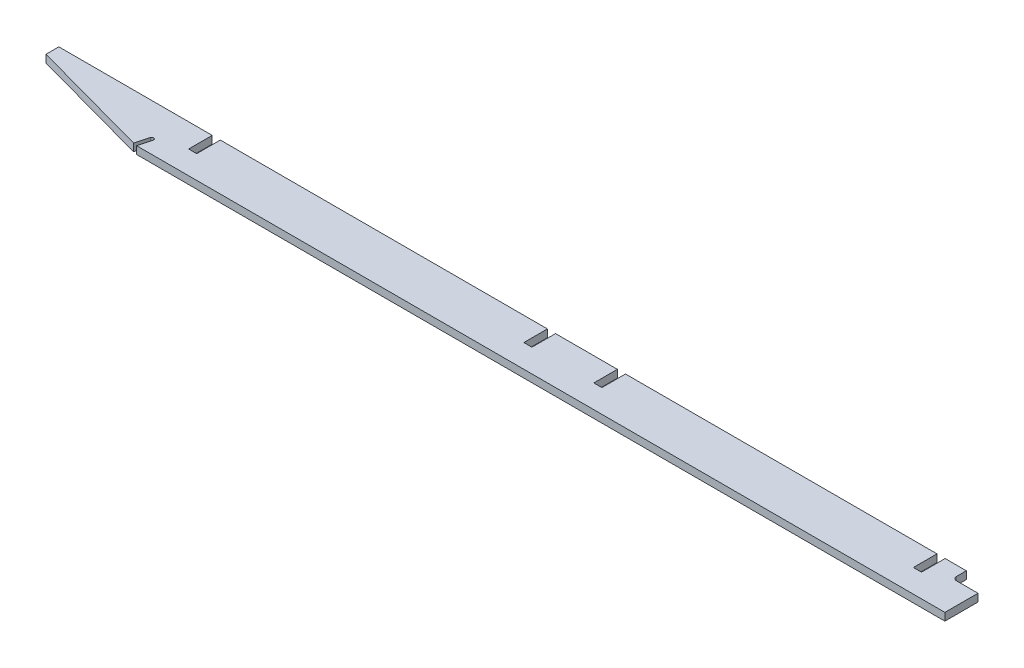
ISO-10303-21;
HEADER;
FILE_DESCRIPTION(('STEP AP214'),'2;1');
FILE_NAME('part.step','',(''),(''),'','','');
FILE_SCHEMA(('AUTOMOTIVE_DESIGN { 1 0 10303 214 1 1 1 1 }'));
ENDSEC;
DATA;
#1=APPLICATION_CONTEXT('core data for automotive mechanical design processes');
#2=APPLICATION_PROTOCOL_DEFINITION('international standard','automotive_design',2000,#1);
#3=PRODUCT_CONTEXT('',#1,'mechanical');
#4=PRODUCT('Part','Part','',(#3));
#5=PRODUCT_RELATED_PRODUCT_CATEGORY('part','',(#4));
#6=PRODUCT_DEFINITION_FORMATION('','',#4);
#7=PRODUCT_DEFINITION_CONTEXT('part definition',#1,'design');
#8=PRODUCT_DEFINITION('design','',#6,#7);
#9=PRODUCT_DEFINITION_SHAPE('','',#8);
#10=(LENGTH_UNIT() NAMED_UNIT(*) SI_UNIT(.MILLI.,.METRE.));
#11=(NAMED_UNIT(*) PLANE_ANGLE_UNIT() SI_UNIT($,.RADIAN.));
#12=(NAMED_UNIT(*) SI_UNIT($,.STERADIAN.) SOLID_ANGLE_UNIT());
#13=UNCERTAINTY_MEASURE_WITH_UNIT(LENGTH_MEASURE(1.E-05),#10,'distance_accuracy_value','');
#14=(GEOMETRIC_REPRESENTATION_CONTEXT(3) GLOBAL_UNCERTAINTY_ASSIGNED_CONTEXT((#13)) GLOBAL_UNIT_ASSIGNED_CONTEXT((#10,
#11,#12)) REPRESENTATION_CONTEXT('',''));
#15=CARTESIAN_POINT('',(0.,0.,0.));
#16=DIRECTION('',(0.,0.,1.));
#17=DIRECTION('',(1.,0.,0.));
#18=AXIS2_PLACEMENT_3D('',#15,#16,#17);
#19=CARTESIAN_POINT('',(-1457.76984888733,387.096,38.1));
#20=DIRECTION('',(-0.26471698178117,0.,0.964326147917118));
#21=DIRECTION('',(0.964326147917118,0.,0.26471698178117));
#22=AXIS2_PLACEMENT_3D('',#19,#20,#21);
#23=PLANE('',#22);
#24=DIRECTION('',(-0.964326147917118,0.,-0.26471698178117));
#25=VECTOR('',#24,1.);
#26=CARTESIAN_POINT('',(-1457.76984888733,374.65,38.1));
#27=LINE('',#26,#25);
#28=CARTESIAN_POINT('',(-1323.73398806948,374.65,74.8941578715673));
#29=VERTEX_POINT('',#28);
#30=CARTESIAN_POINT('',(-1520.36270603019,374.65,20.9176470588235));
#31=VERTEX_POINT('',#30);
#32=EDGE_CURVE('E696',#29,#31,#27,.T.);
#33=ORIENTED_EDGE('',*,*,#32,.F.);
#34=DIRECTION('',(0.,1.,0.));
#35=VECTOR('',#34,1.);
#36=CARTESIAN_POINT('',(-1323.73398806948,-2244.13415908109,74.8941578715673));
#37=LINE('',#36,#35);
#38=CARTESIAN_POINT('',(-1323.73398806948,387.096,74.8941578715673));
#39=VERTEX_POINT('',#38);
#40=EDGE_CURVE('E258',#29,#39,#37,.T.);
#41=ORIENTED_EDGE('',*,*,#40,.T.);
#42=DIRECTION('',(-0.964326147917118,0.,-0.26471698178117));
#43=VECTOR('',#42,1.);
#44=CARTESIAN_POINT('',(-1457.76984888733,387.096,38.1));
#45=LINE('',#44,#43);
#46=CARTESIAN_POINT('',(-1520.36270603019,387.096,20.9176470588235));
#47=VERTEX_POINT('',#46);
#48=EDGE_CURVE('E725',#39,#47,#45,.T.);
#49=ORIENTED_EDGE('',*,*,#48,.T.);
#50=DIRECTION('',(0.,-1.,0.));
#51=VECTOR('',#50,1.);
#52=CARTESIAN_POINT('',(-1520.36270603019,387.096,20.9176470588235));
#53=LINE('',#52,#51);
#54=EDGE_CURVE('E300',#47,#31,#53,.T.);
#55=ORIENTED_EDGE('',*,*,#54,.T.);
#56=EDGE_LOOP('',(#33,#41,#49,#55));
#57=FACE_BOUND('',#56,.T.);
#58=ADVANCED_FACE('F14',(#57),#23,.T.);
#59=CARTESIAN_POINT('',(-798.281353015096,387.096,44.45));
#60=DIRECTION('',(0.,-1.,0.));
#61=DIRECTION('',(1.,0.,0.));
#62=AXIS2_PLACEMENT_3D('',#59,#60,#61);
#63=PLANE('',#62);
#64=DIRECTION('',(0.26471698178117,0.,-0.964326147917118));
#65=VECTOR('',#64,1.);
#66=CARTESIAN_POINT('',(-1273.01779440205,387.096,-85.8698074395561));
#67=LINE('',#66,#65);
#68=CARTESIAN_POINT('',(-1317.50754546389,387.096,76.2));
#69=VERTEX_POINT('',#68);
#70=CARTESIAN_POINT('',(-1311.72718211012,387.096,55.1429620684198));
#71=VERTEX_POINT('',#70);
#72=EDGE_CURVE('E824',#69,#71,#67,.T.);
#73=ORIENTED_EDGE('',*,*,#72,.F.);
#74=DIRECTION('',(1.,0.,0.));
#75=VECTOR('',#74,1.);
#76=CARTESIAN_POINT('',(-660.4,387.096,76.2));
#77=LINE('',#76,#75);
#78=CARTESIAN_POINT('',(2.22044604925032E-13,387.096,76.2));
#79=VERTEX_POINT('',#78);
#80=EDGE_CURVE('E730',#69,#79,#77,.T.);
#81=ORIENTED_EDGE('',*,*,#80,.T.);
#82=DIRECTION('',(0.,0.,1.));
#83=VECTOR('',#82,1.);
#84=CARTESIAN_POINT('',(2.22044604925032E-13,387.096,44.45));
#85=LINE('',#84,#83);
#86=CARTESIAN_POINT('',(2.22044604925032E-13,387.096,22.225));
#87=VERTEX_POINT('',#86);
#88=EDGE_CURVE('E726',#87,#79,#85,.T.);
#89=ORIENTED_EDGE('',*,*,#88,.F.);
#90=DIRECTION('',(-1.,0.,0.));
#91=VECTOR('',#90,1.);
#92=CARTESIAN_POINT('',(-798.281353015096,387.096,22.225));
#93=LINE('',#92,#91);
#94=CARTESIAN_POINT('',(-34.925,387.096,22.225));
#95=VERTEX_POINT('',#94);
#96=EDGE_CURVE('E307',#87,#95,#93,.T.);
#97=ORIENTED_EDGE('',*,*,#96,.T.);
#98=CARTESIAN_POINT('',(-34.925,387.096,15.875));
#99=DIRECTION('',(0.,-1.,0.));
#100=DIRECTION('',(0.,0.,-1.));
#101=AXIS2_PLACEMENT_3D('',#98,#99,#100);
#102=CIRCLE('',#101,6.35);
#103=CARTESIAN_POINT('',(-41.275,387.096,15.875));
#104=VERTEX_POINT('',#103);
#105=EDGE_CURVE('E23',#95,#104,#102,.T.);
#106=ORIENTED_EDGE('',*,*,#105,.T.);
#107=DIRECTION('',(0.,0.,-1.));
#108=VECTOR('',#107,1.);
#109=CARTESIAN_POINT('',(-41.275,387.096,44.45));
#110=LINE('',#109,#108);
#111=CARTESIAN_POINT('',(-41.275,387.096,0.));
#112=VERTEX_POINT('',#111);
#113=EDGE_CURVE('E303',#104,#112,#110,.T.);
#114=ORIENTED_EDGE('',*,*,#113,.T.);
#115=DIRECTION('',(1.,0.,0.));
#116=VECTOR('',#115,1.);
#117=CARTESIAN_POINT('',(-931.631353015096,387.096,0.));
#118=LINE('',#117,#116);
#119=CARTESIAN_POINT('',(-75.803125,387.096,0.));
#120=VERTEX_POINT('',#119);
#121=EDGE_CURVE('E701',#120,#112,#118,.T.);
#122=ORIENTED_EDGE('',*,*,#121,.F.);
#123=DIRECTION('',(0.,0.,-1.));
#124=VECTOR('',#123,1.);
#125=CARTESIAN_POINT('',(-75.803125,387.096,38.1));
#126=LINE('',#125,#124);
#127=CARTESIAN_POINT('',(-75.803125,387.096,38.496875));
#128=VERTEX_POINT('',#127);
#129=EDGE_CURVE('E306',#128,#120,#126,.T.);
#130=ORIENTED_EDGE('',*,*,#129,.F.);
#131=DIRECTION('',(-1.,0.,0.));
#132=VECTOR('',#131,1.);
#133=CARTESIAN_POINT('',(-59.5983301642671,387.096,38.496875));
#134=LINE('',#133,#132);
#135=CARTESIAN_POINT('',(-89.0428750000001,387.096,38.496875));
#136=VERTEX_POINT('',#135);
#137=EDGE_CURVE('E847',#128,#136,#134,.T.);
#138=ORIENTED_EDGE('',*,*,#137,.T.);
#139=DIRECTION('',(0.,0.,1.));
#140=VECTOR('',#139,1.);
#141=CARTESIAN_POINT('',(-89.0428750000001,387.096,38.1));
#142=LINE('',#141,#140);
#143=CARTESIAN_POINT('',(-89.0428750000001,387.096,0.));
#144=VERTEX_POINT('',#143);
#145=EDGE_CURVE('E844',#144,#136,#142,.T.);
#146=ORIENTED_EDGE('',*,*,#145,.F.);
#147=CARTESIAN_POINT('',(-596.773,387.096,0.));
#148=VERTEX_POINT('',#147);
#149=EDGE_CURVE('E708',#148,#144,#118,.T.);
#150=ORIENTED_EDGE('',*,*,#149,.F.);
#151=DIRECTION('',(0.,0.,1.));
#152=VECTOR('',#151,1.);
#153=CARTESIAN_POINT('',(-596.773,387.096,44.45));
#154=LINE('',#153,#152);
#155=CARTESIAN_POINT('',(-596.773,387.096,38.481));
#156=VERTEX_POINT('',#155);
#157=EDGE_CURVE('E808',#148,#156,#154,.T.);
#158=ORIENTED_EDGE('',*,*,#157,.T.);
#159=DIRECTION('',(-1.,0.,0.));
#160=VECTOR('',#159,1.);
#161=CARTESIAN_POINT('',(-798.281353015096,387.096,38.481));
#162=LINE('',#161,#160);
#163=CARTESIAN_POINT('',(-609.981,387.096,38.481));
#164=VERTEX_POINT('',#163);
#165=EDGE_CURVE('E800',#156,#164,#162,.T.);
#166=ORIENTED_EDGE('',*,*,#165,.T.);
#167=DIRECTION('',(0.,0.,-1.));
#168=VECTOR('',#167,1.);
#169=CARTESIAN_POINT('',(-609.981,387.096,44.45));
#170=LINE('',#169,#168);
#171=CARTESIAN_POINT('',(-609.981,387.096,0.));
#172=VERTEX_POINT('',#171);
#173=EDGE_CURVE('E925',#164,#172,#170,.T.);
#174=ORIENTED_EDGE('',*,*,#173,.T.);
#175=CARTESIAN_POINT('',(-710.819,387.096,0.));
#176=VERTEX_POINT('',#175);
#177=EDGE_CURVE('E947',#176,#172,#118,.T.);
#178=ORIENTED_EDGE('',*,*,#177,.F.);
#179=DIRECTION('',(0.,0.,1.));
#180=VECTOR('',#179,1.);
#181=CARTESIAN_POINT('',(-710.819,387.096,44.45));
#182=LINE('',#181,#180);
#183=CARTESIAN_POINT('',(-710.819,387.096,38.481));
#184=VERTEX_POINT('',#183);
#185=EDGE_CURVE('E907',#176,#184,#182,.T.);
#186=ORIENTED_EDGE('',*,*,#185,.T.);
#187=DIRECTION('',(-1.,0.,0.));
#188=VECTOR('',#187,1.);
#189=CARTESIAN_POINT('',(-798.281353015096,387.096,38.481));
#190=LINE('',#189,#188);
#191=CARTESIAN_POINT('',(-724.027,387.096,38.481));
#192=VERTEX_POINT('',#191);
#193=EDGE_CURVE('E911',#184,#192,#190,.T.);
#194=ORIENTED_EDGE('',*,*,#193,.T.);
#195=DIRECTION('',(0.,0.,-1.));
#196=VECTOR('',#195,1.);
#197=CARTESIAN_POINT('',(-724.027,387.096,44.45));
#198=LINE('',#197,#196);
#199=CARTESIAN_POINT('',(-724.027,387.096,0.));
#200=VERTEX_POINT('',#199);
#201=EDGE_CURVE('E918',#192,#200,#198,.T.);
#202=ORIENTED_EDGE('',*,*,#201,.T.);
#203=CARTESIAN_POINT('',(-1257.173,387.096,0.));
#204=VERTEX_POINT('',#203);
#205=EDGE_CURVE('E819',#204,#200,#118,.T.);
#206=ORIENTED_EDGE('',*,*,#205,.F.);
#207=DIRECTION('',(0.,0.,1.));
#208=VECTOR('',#207,1.);
#209=CARTESIAN_POINT('',(-1257.173,387.096,44.45));
#210=LINE('',#209,#208);
#211=CARTESIAN_POINT('',(-1257.173,387.096,38.481));
#212=VERTEX_POINT('',#211);
#213=EDGE_CURVE('E891',#204,#212,#210,.T.);
#214=ORIENTED_EDGE('',*,*,#213,.T.);
#215=DIRECTION('',(-1.,0.,0.));
#216=VECTOR('',#215,1.);
#217=CARTESIAN_POINT('',(-798.281353015096,387.096,38.481));
#218=LINE('',#217,#216);
#219=CARTESIAN_POINT('',(-1270.381,387.096,38.481));
#220=VERTEX_POINT('',#219);
#221=EDGE_CURVE('E895',#212,#220,#218,.T.);
#222=ORIENTED_EDGE('',*,*,#221,.T.);
#223=DIRECTION('',(0.,0.,-1.));
#224=VECTOR('',#223,1.);
#225=CARTESIAN_POINT('',(-1270.381,387.096,44.45));
#226=LINE('',#225,#224);
#227=CARTESIAN_POINT('',(-1270.381,387.096,0.));
#228=VERTEX_POINT('',#227);
#229=EDGE_CURVE('E901',#220,#228,#226,.T.);
#230=ORIENTED_EDGE('',*,*,#229,.T.);
#231=CARTESIAN_POINT('',(-1520.36270603019,387.096,0.));
#232=VERTEX_POINT('',#231);
#233=EDGE_CURVE('E710',#232,#228,#118,.T.);
#234=ORIENTED_EDGE('',*,*,#233,.F.);
#235=DIRECTION('',(0.,0.,-1.));
#236=VECTOR('',#235,1.);
#237=CARTESIAN_POINT('',(-1520.36270603019,387.096,20.9176470588235));
#238=LINE('',#237,#236);
#239=EDGE_CURVE('E264',#232,#47,#238,.F.);
#240=ORIENTED_EDGE('',*,*,#239,.T.);
#241=ORIENTED_EDGE('',*,*,#48,.F.);
#242=DIRECTION('',(0.26471698178117,0.,-0.964326147917118));
#243=VECTOR('',#242,1.);
#244=CARTESIAN_POINT('',(-1279.14126544132,387.096,-87.5507602738665));
#245=LINE('',#244,#243);
#246=CARTESIAN_POINT('',(-1317.8506531494,387.096,53.4620092341093));
#247=VERTEX_POINT('',#246);
#248=EDGE_CURVE('E1115',#39,#247,#245,.T.);
#249=ORIENTED_EDGE('',*,*,#248,.T.);
#250=CARTESIAN_POINT('',(-1314.78891762976,387.096,54.3024856512645));
#251=DIRECTION('',(0.,-1.,0.));
#252=DIRECTION('',(0.,0.,-1.));
#253=AXIS2_PLACEMENT_3D('',#250,#251,#252);
#254=CIRCLE('',#253,3.175);
#255=EDGE_CURVE('E271',#247,#71,#254,.T.);
#256=ORIENTED_EDGE('',*,*,#255,.T.);
#257=EDGE_LOOP('',(#73,#81,#89,#97,#106,#114,#122,#130,#138,#146,#150,#158,#166,#174,#178,#186,
#194,#202,#206,#214,#222,#230,#234,#240,#241,#249,#256));
#258=FACE_BOUND('',#257,.T.);
#259=ADVANCED_FACE('F359',(#258),#63,.F.);
#260=CARTESIAN_POINT('',(-660.4,387.096,76.2));
#261=DIRECTION('',(0.,0.,-1.));
#262=DIRECTION('',(-1.,0.,0.));
#263=AXIS2_PLACEMENT_3D('',#260,#261,#262);
#264=PLANE('',#263);
#265=DIRECTION('',(0.,1.,0.));
#266=VECTOR('',#265,1.);
#267=CARTESIAN_POINT('',(-1317.50754546389,387.096,76.2));
#268=LINE('',#267,#266);
#269=CARTESIAN_POINT('',(-1317.50754546389,374.65,76.2));
#270=VERTEX_POINT('',#269);
#271=EDGE_CURVE('E829',#270,#69,#268,.T.);
#272=ORIENTED_EDGE('',*,*,#271,.F.);
#273=DIRECTION('',(1.,0.,0.));
#274=VECTOR('',#273,1.);
#275=CARTESIAN_POINT('',(-660.4,374.65,76.2));
#276=LINE('',#275,#274);
#277=CARTESIAN_POINT('',(2.22044604925032E-13,374.65,76.2));
#278=VERTEX_POINT('',#277);
#279=EDGE_CURVE('E702',#270,#278,#276,.T.);
#280=ORIENTED_EDGE('',*,*,#279,.T.);
#281=DIRECTION('',(0.,-1.,0.));
#282=VECTOR('',#281,1.);
#283=CARTESIAN_POINT('',(2.22044604925032E-13,387.096,76.2));
#284=LINE('',#283,#282);
#285=EDGE_CURVE('E720',#79,#278,#284,.T.);
#286=ORIENTED_EDGE('',*,*,#285,.F.);
#287=ORIENTED_EDGE('',*,*,#80,.F.);
#288=EDGE_LOOP('',(#272,#280,#286,#287));
#289=FACE_BOUND('',#288,.T.);
#290=ADVANCED_FACE('F353',(#289),#264,.F.);
#291=CARTESIAN_POINT('',(-798.281353015096,374.65,44.45));
#292=DIRECTION('',(0.,-1.,0.));
#293=DIRECTION('',(1.,0.,0.));
#294=AXIS2_PLACEMENT_3D('',#291,#292,#293);
#295=PLANE('',#294);
#296=ORIENTED_EDGE('',*,*,#279,.F.);
#297=DIRECTION('',(0.26471698178117,0.,-0.964326147917118));
#298=VECTOR('',#297,1.);
#299=CARTESIAN_POINT('',(-1273.01779440205,374.65,-85.8698074395561));
#300=LINE('',#299,#298);
#301=CARTESIAN_POINT('',(-1311.72718211012,374.65,55.1429620684198));
#302=VERTEX_POINT('',#301);
#303=EDGE_CURVE('E278',#270,#302,#300,.T.);
#304=ORIENTED_EDGE('',*,*,#303,.T.);
#305=CARTESIAN_POINT('',(-1314.78891762976,374.65,54.3024856512645));
#306=DIRECTION('',(0.,-1.,0.));
#307=DIRECTION('',(0.,0.,-1.));
#308=AXIS2_PLACEMENT_3D('',#305,#306,#307);
#309=CIRCLE('',#308,3.175);
#310=CARTESIAN_POINT('',(-1317.8506531494,374.65,53.4620092341093));
#311=VERTEX_POINT('',#310);
#312=EDGE_CURVE('E263',#311,#302,#309,.T.);
#313=ORIENTED_EDGE('',*,*,#312,.F.);
#314=DIRECTION('',(0.26471698178117,0.,-0.964326147917118));
#315=VECTOR('',#314,1.);
#316=CARTESIAN_POINT('',(-1279.14126544132,374.65,-87.5507602738665));
#317=LINE('',#316,#315);
#318=EDGE_CURVE('E252',#29,#311,#317,.T.);
#319=ORIENTED_EDGE('',*,*,#318,.F.);
#320=ORIENTED_EDGE('',*,*,#32,.T.);
#321=DIRECTION('',(0.,0.,1.));
#322=VECTOR('',#321,1.);
#323=CARTESIAN_POINT('',(-1520.36270603019,374.65,44.4500000000076));
#324=LINE('',#323,#322);
#325=CARTESIAN_POINT('',(-1520.36270603019,374.65,0.));
#326=VERTEX_POINT('',#325);
#327=EDGE_CURVE('E770',#31,#326,#324,.F.);
#328=ORIENTED_EDGE('',*,*,#327,.T.);
#329=DIRECTION('',(1.,0.,0.));
#330=VECTOR('',#329,1.);
#331=CARTESIAN_POINT('',(-931.631353015096,374.65,0.));
#332=LINE('',#331,#330);
#333=CARTESIAN_POINT('',(-1270.381,374.65,-1.45716771982052E-13));
#334=VERTEX_POINT('',#333);
#335=EDGE_CURVE('E719',#326,#334,#332,.T.);
#336=ORIENTED_EDGE('',*,*,#335,.T.);
#337=DIRECTION('',(0.,0.,-1.));
#338=VECTOR('',#337,1.);
#339=CARTESIAN_POINT('',(-1270.381,374.65,44.45));
#340=LINE('',#339,#338);
#341=CARTESIAN_POINT('',(-1270.381,374.65,38.481));
#342=VERTEX_POINT('',#341);
#343=EDGE_CURVE('E736',#342,#334,#340,.T.);
#344=ORIENTED_EDGE('',*,*,#343,.F.);
#345=DIRECTION('',(-1.,0.,0.));
#346=VECTOR('',#345,1.);
#347=CARTESIAN_POINT('',(-798.281353015096,374.65,38.481));
#348=LINE('',#347,#346);
#349=CARTESIAN_POINT('',(-1257.173,374.65,38.481));
#350=VERTEX_POINT('',#349);
#351=EDGE_CURVE('E733',#350,#342,#348,.T.);
#352=ORIENTED_EDGE('',*,*,#351,.F.);
#353=DIRECTION('',(0.,0.,1.));
#354=VECTOR('',#353,1.);
#355=CARTESIAN_POINT('',(-1257.173,374.65,44.45));
#356=LINE('',#355,#354);
#357=CARTESIAN_POINT('',(-1257.173,374.65,0.));
#358=VERTEX_POINT('',#357);
#359=EDGE_CURVE('E724',#358,#350,#356,.T.);
#360=ORIENTED_EDGE('',*,*,#359,.F.);
#361=CARTESIAN_POINT('',(-724.027,374.65,-1.45716771982052E-13));
#362=VERTEX_POINT('',#361);
#363=EDGE_CURVE('E789',#358,#362,#332,.T.);
#364=ORIENTED_EDGE('',*,*,#363,.T.);
#365=DIRECTION('',(0.,0.,-1.));
#366=VECTOR('',#365,1.);
#367=CARTESIAN_POINT('',(-724.027,374.65,44.45));
#368=LINE('',#367,#366);
#369=CARTESIAN_POINT('',(-724.027,374.65,38.481));
#370=VERTEX_POINT('',#369);
#371=EDGE_CURVE('E746',#370,#362,#368,.T.);
#372=ORIENTED_EDGE('',*,*,#371,.F.);
#373=DIRECTION('',(-1.,0.,0.));
#374=VECTOR('',#373,1.);
#375=CARTESIAN_POINT('',(-798.281353015096,374.65,38.481));
#376=LINE('',#375,#374);
#377=CARTESIAN_POINT('',(-710.819,374.65,38.481));
#378=VERTEX_POINT('',#377);
#379=EDGE_CURVE('E743',#378,#370,#376,.T.);
#380=ORIENTED_EDGE('',*,*,#379,.F.);
#381=DIRECTION('',(0.,0.,1.));
#382=VECTOR('',#381,1.);
#383=CARTESIAN_POINT('',(-710.819,374.65,44.45));
#384=LINE('',#383,#382);
#385=CARTESIAN_POINT('',(-710.819,374.65,0.));
#386=VERTEX_POINT('',#385);
#387=EDGE_CURVE('E740',#386,#378,#384,.T.);
#388=ORIENTED_EDGE('',*,*,#387,.F.);
#389=CARTESIAN_POINT('',(-609.981,374.65,-1.45716771982052E-13));
#390=VERTEX_POINT('',#389);
#391=EDGE_CURVE('E795',#386,#390,#332,.T.);
#392=ORIENTED_EDGE('',*,*,#391,.T.);
#393=DIRECTION('',(0.,0.,-1.));
#394=VECTOR('',#393,1.);
#395=CARTESIAN_POINT('',(-609.981,374.65,44.45));
#396=LINE('',#395,#394);
#397=CARTESIAN_POINT('',(-609.981,374.65,38.481));
#398=VERTEX_POINT('',#397);
#399=EDGE_CURVE('E749',#398,#390,#396,.T.);
#400=ORIENTED_EDGE('',*,*,#399,.F.);
#401=DIRECTION('',(-1.,0.,0.));
#402=VECTOR('',#401,1.);
#403=CARTESIAN_POINT('',(-798.281353015096,374.65,38.481));
#404=LINE('',#403,#402);
#405=CARTESIAN_POINT('',(-596.773,374.65,38.481));
#406=VERTEX_POINT('',#405);
#407=EDGE_CURVE('E752',#406,#398,#404,.T.);
#408=ORIENTED_EDGE('',*,*,#407,.F.);
#409=DIRECTION('',(0.,0.,1.));
#410=VECTOR('',#409,1.);
#411=CARTESIAN_POINT('',(-596.773,374.65,44.45));
#412=LINE('',#411,#410);
#413=CARTESIAN_POINT('',(-596.773,374.65,-1.45716771982052E-13));
#414=VERTEX_POINT('',#413);
#415=EDGE_CURVE('E756',#414,#406,#412,.T.);
#416=ORIENTED_EDGE('',*,*,#415,.F.);
#417=CARTESIAN_POINT('',(-89.0428750000001,374.65,-1.45716771982052E-13));
#418=VERTEX_POINT('',#417);
#419=EDGE_CURVE('E799',#414,#418,#332,.T.);
#420=ORIENTED_EDGE('',*,*,#419,.T.);
#421=DIRECTION('',(0.,0.,-1.));
#422=VECTOR('',#421,1.);
#423=CARTESIAN_POINT('',(-89.0428750000001,374.65,44.45));
#424=LINE('',#423,#422);
#425=CARTESIAN_POINT('',(-89.0428750000001,374.65,38.496875));
#426=VERTEX_POINT('',#425);
#427=EDGE_CURVE('E312',#426,#418,#424,.T.);
#428=ORIENTED_EDGE('',*,*,#427,.F.);
#429=DIRECTION('',(1.,0.,0.));
#430=VECTOR('',#429,1.);
#431=CARTESIAN_POINT('',(-798.281353015096,374.65,38.4968750000003));
#432=LINE('',#431,#430);
#433=CARTESIAN_POINT('',(-75.803125,374.65,38.496875));
#434=VERTEX_POINT('',#433);
#435=EDGE_CURVE('E762',#426,#434,#432,.T.);
#436=ORIENTED_EDGE('',*,*,#435,.T.);
#437=DIRECTION('',(0.,0.,1.));
#438=VECTOR('',#437,1.);
#439=CARTESIAN_POINT('',(-75.803125,374.65,44.45));
#440=LINE('',#439,#438);
#441=CARTESIAN_POINT('',(-75.803125,374.65,0.));
#442=VERTEX_POINT('',#441);
#443=EDGE_CURVE('E759',#442,#434,#440,.T.);
#444=ORIENTED_EDGE('',*,*,#443,.F.);
#445=CARTESIAN_POINT('',(-41.275,374.65,0.));
#446=VERTEX_POINT('',#445);
#447=EDGE_CURVE('E790',#442,#446,#332,.T.);
#448=ORIENTED_EDGE('',*,*,#447,.T.);
#449=DIRECTION('',(0.,0.,-1.));
#450=VECTOR('',#449,1.);
#451=CARTESIAN_POINT('',(-41.275,374.65,44.45));
#452=LINE('',#451,#450);
#453=CARTESIAN_POINT('',(-41.275,374.65,15.875));
#454=VERTEX_POINT('',#453);
#455=EDGE_CURVE('E297',#454,#446,#452,.T.);
#456=ORIENTED_EDGE('',*,*,#455,.F.);
#457=CARTESIAN_POINT('',(-34.925,374.65,15.875));
#458=DIRECTION('',(0.,-1.,0.));
#459=DIRECTION('',(0.,0.,-1.));
#460=AXIS2_PLACEMENT_3D('',#457,#458,#459);
#461=CIRCLE('',#460,6.35);
#462=CARTESIAN_POINT('',(-34.925,374.65,22.225));
#463=VERTEX_POINT('',#462);
#464=EDGE_CURVE('E9',#454,#463,#461,.F.);
#465=ORIENTED_EDGE('',*,*,#464,.T.);
#466=DIRECTION('',(-1.,0.,0.));
#467=VECTOR('',#466,1.);
#468=CARTESIAN_POINT('',(-798.281353015096,374.65,22.225));
#469=LINE('',#468,#467);
#470=CARTESIAN_POINT('',(2.22044604925032E-13,374.65,22.225));
#471=VERTEX_POINT('',#470);
#472=EDGE_CURVE('E301',#471,#463,#469,.T.);
#473=ORIENTED_EDGE('',*,*,#472,.F.);
#474=DIRECTION('',(0.,0.,1.));
#475=VECTOR('',#474,1.);
#476=CARTESIAN_POINT('',(2.22044604925032E-13,374.65,44.45));
#477=LINE('',#476,#475);
#478=EDGE_CURVE('E712',#471,#278,#477,.T.);
#479=ORIENTED_EDGE('',*,*,#478,.T.);
#480=EDGE_LOOP('',(#296,#304,#313,#319,#320,#328,#336,#344,#352,#360,#364,#372,#380,#388,#392,
#400,#408,#416,#420,#428,#436,#444,#448,#456,#465,#473,#479));
#481=FACE_BOUND('',#480,.T.);
#482=ADVANCED_FACE('F277',(#481),#295,.T.);
#483=CARTESIAN_POINT('',(-931.631353015096,387.096,0.));
#484=DIRECTION('',(0.,0.,-1.));
#485=DIRECTION('',(-1.,0.,0.));
#486=AXIS2_PLACEMENT_3D('',#483,#484,#485);
#487=PLANE('',#486);
#488=DIRECTION('',(0.,1.,0.));
#489=VECTOR('',#488,1.);
#490=CARTESIAN_POINT('',(-89.0428750000001,387.096,0.));
#491=LINE('',#490,#489);
#492=EDGE_CURVE('E861',#418,#144,#491,.T.);
#493=ORIENTED_EDGE('',*,*,#492,.F.);
#494=ORIENTED_EDGE('',*,*,#419,.F.);
#495=DIRECTION('',(0.,-1.,0.));
#496=VECTOR('',#495,1.);
#497=CARTESIAN_POINT('',(-596.773,387.096,0.));
#498=LINE('',#497,#496);
#499=EDGE_CURVE('E815',#148,#414,#498,.T.);
#500=ORIENTED_EDGE('',*,*,#499,.F.);
#501=ORIENTED_EDGE('',*,*,#149,.T.);
#502=EDGE_LOOP('',(#493,#494,#500,#501));
#503=FACE_BOUND('',#502,.T.);
#504=ADVANCED_FACE('F352',(#503),#487,.T.);
#505=DIRECTION('',(0.,1.,0.));
#506=VECTOR('',#505,1.);
#507=CARTESIAN_POINT('',(-41.275,-2295.26058781173,0.));
#508=LINE('',#507,#506);
#509=EDGE_CURVE('E834',#446,#112,#508,.T.);
#510=ORIENTED_EDGE('',*,*,#509,.F.);
#511=ORIENTED_EDGE('',*,*,#447,.F.);
#512=DIRECTION('',(0.,-1.,0.));
#513=VECTOR('',#512,1.);
#514=CARTESIAN_POINT('',(-75.8031250000001,387.096,0.));
#515=LINE('',#514,#513);
#516=EDGE_CURVE('E856',#120,#442,#515,.T.);
#517=ORIENTED_EDGE('',*,*,#516,.F.);
#518=ORIENTED_EDGE('',*,*,#121,.T.);
#519=EDGE_LOOP('',(#510,#511,#517,#518));
#520=FACE_BOUND('',#519,.T.);
#521=ADVANCED_FACE('F400',(#520),#487,.T.);
#522=DIRECTION('',(0.,1.,0.));
#523=VECTOR('',#522,1.);
#524=CARTESIAN_POINT('',(-724.027,387.096,0.));
#525=LINE('',#524,#523);
#526=EDGE_CURVE('E915',#362,#200,#525,.T.);
#527=ORIENTED_EDGE('',*,*,#526,.F.);
#528=ORIENTED_EDGE('',*,*,#363,.F.);
#529=DIRECTION('',(0.,-1.,0.));
#530=VECTOR('',#529,1.);
#531=CARTESIAN_POINT('',(-1257.173,387.096,0.));
#532=LINE('',#531,#530);
#533=EDGE_CURVE('E874',#204,#358,#532,.T.);
#534=ORIENTED_EDGE('',*,*,#533,.F.);
#535=ORIENTED_EDGE('',*,*,#205,.T.);
#536=EDGE_LOOP('',(#527,#528,#534,#535));
#537=FACE_BOUND('',#536,.T.);
#538=ADVANCED_FACE('F413',(#537),#487,.T.);
#539=ORIENTED_EDGE('',*,*,#335,.F.);
#540=DIRECTION('',(0.,1.,0.));
#541=VECTOR('',#540,1.);
#542=CARTESIAN_POINT('',(-1520.36270603019,387.096,0.));
#543=LINE('',#542,#541);
#544=EDGE_CURVE('E773',#326,#232,#543,.T.);
#545=ORIENTED_EDGE('',*,*,#544,.T.);
#546=ORIENTED_EDGE('',*,*,#233,.T.);
#547=DIRECTION('',(0.,1.,0.));
#548=VECTOR('',#547,1.);
#549=CARTESIAN_POINT('',(-1270.381,387.096,0.));
#550=LINE('',#549,#548);
#551=EDGE_CURVE('E788',#334,#228,#550,.T.);
#552=ORIENTED_EDGE('',*,*,#551,.F.);
#553=EDGE_LOOP('',(#539,#545,#546,#552));
#554=FACE_BOUND('',#553,.T.);
#555=ADVANCED_FACE('F424',(#554),#487,.T.);
#556=DIRECTION('',(0.,1.,0.));
#557=VECTOR('',#556,1.);
#558=CARTESIAN_POINT('',(-609.981,387.096,0.));
#559=LINE('',#558,#557);
#560=EDGE_CURVE('E922',#390,#172,#559,.T.);
#561=ORIENTED_EDGE('',*,*,#560,.F.);
#562=ORIENTED_EDGE('',*,*,#391,.F.);
#563=DIRECTION('',(0.,-1.,0.));
#564=VECTOR('',#563,1.);
#565=CARTESIAN_POINT('',(-710.819,387.096,0.));
#566=LINE('',#565,#564);
#567=EDGE_CURVE('E904',#176,#386,#566,.T.);
#568=ORIENTED_EDGE('',*,*,#567,.F.);
#569=ORIENTED_EDGE('',*,*,#177,.T.);
#570=EDGE_LOOP('',(#561,#562,#568,#569));
#571=FACE_BOUND('',#570,.T.);
#572=ADVANCED_FACE('F403',(#571),#487,.T.);
#573=CARTESIAN_POINT('',(2.22044604925032E-13,387.096,38.1));
#574=DIRECTION('',(1.,0.,0.));
#575=DIRECTION('',(0.,0.,-1.));
#576=AXIS2_PLACEMENT_3D('',#573,#574,#575);
#577=PLANE('',#576);
#578=DIRECTION('',(0.,-1.,0.));
#579=VECTOR('',#578,1.);
#580=CARTESIAN_POINT('',(2.22044604925032E-13,387.096,22.225));
#581=LINE('',#580,#579);
#582=EDGE_CURVE('E316',#87,#471,#581,.T.);
#583=ORIENTED_EDGE('',*,*,#582,.F.);
#584=ORIENTED_EDGE('',*,*,#88,.T.);
#585=ORIENTED_EDGE('',*,*,#285,.T.);
#586=ORIENTED_EDGE('',*,*,#478,.F.);
#587=EDGE_LOOP('',(#583,#584,#585,#586));
#588=FACE_BOUND('',#587,.T.);
#589=ADVANCED_FACE('F445',(#588),#577,.T.);
#590=CARTESIAN_POINT('',(-1270.381,-2244.46058781173,38.1));
#591=DIRECTION('',(-1.,0.,0.));
#592=DIRECTION('',(0.,0.,1.));
#593=AXIS2_PLACEMENT_3D('',#590,#591,#592);
#594=PLANE('',#593);
#595=DIRECTION('',(0.,1.,0.));
#596=VECTOR('',#595,1.);
#597=CARTESIAN_POINT('',(-1270.381,-2244.46058781173,38.481));
#598=LINE('',#597,#596);
#599=EDGE_CURVE('E879',#342,#220,#598,.T.);
#600=ORIENTED_EDGE('',*,*,#599,.F.);
#601=ORIENTED_EDGE('',*,*,#343,.T.);
#602=ORIENTED_EDGE('',*,*,#551,.T.);
#603=ORIENTED_EDGE('',*,*,#229,.F.);
#604=EDGE_LOOP('',(#600,#601,#602,#603));
#605=FACE_BOUND('',#604,.T.);
#606=ADVANCED_FACE('F456',(#605),#594,.F.);
#607=CARTESIAN_POINT('',(-936.879,-2244.46058781173,38.481));
#608=DIRECTION('',(0.,0.,1.));
#609=DIRECTION('',(1.,0.,0.));
#610=AXIS2_PLACEMENT_3D('',#607,#608,#609);
#611=PLANE('',#610);
#612=DIRECTION('',(0.,1.,0.));
#613=VECTOR('',#612,1.);
#614=CARTESIAN_POINT('',(-1257.173,-2244.46058781173,38.481));
#615=LINE('',#614,#613);
#616=EDGE_CURVE('E864',#350,#212,#615,.T.);
#617=ORIENTED_EDGE('',*,*,#616,.F.);
#618=ORIENTED_EDGE('',*,*,#351,.T.);
#619=ORIENTED_EDGE('',*,*,#599,.T.);
#620=ORIENTED_EDGE('',*,*,#221,.F.);
#621=EDGE_LOOP('',(#617,#618,#619,#620));
#622=FACE_BOUND('',#621,.T.);
#623=ADVANCED_FACE('F468',(#622),#611,.F.);
#624=CARTESIAN_POINT('',(-1257.173,-2244.46058781173,38.1));
#625=DIRECTION('',(1.,0.,0.));
#626=DIRECTION('',(0.,0.,-1.));
#627=AXIS2_PLACEMENT_3D('',#624,#625,#626);
#628=PLANE('',#627);
#629=ORIENTED_EDGE('',*,*,#533,.T.);
#630=ORIENTED_EDGE('',*,*,#359,.T.);
#631=ORIENTED_EDGE('',*,*,#616,.T.);
#632=ORIENTED_EDGE('',*,*,#213,.F.);
#633=EDGE_LOOP('',(#629,#630,#631,#632));
#634=FACE_BOUND('',#633,.T.);
#635=ADVANCED_FACE('F480',(#634),#628,.F.);
#636=CARTESIAN_POINT('',(-724.027,-2244.46058781173,38.1));
#637=DIRECTION('',(-1.,0.,0.));
#638=DIRECTION('',(0.,0.,1.));
#639=AXIS2_PLACEMENT_3D('',#636,#637,#638);
#640=PLANE('',#639);
#641=DIRECTION('',(0.,1.,0.));
#642=VECTOR('',#641,1.);
#643=CARTESIAN_POINT('',(-724.027,-2244.46058781173,38.481));
#644=LINE('',#643,#642);
#645=EDGE_CURVE('E870',#370,#192,#644,.T.);
#646=ORIENTED_EDGE('',*,*,#645,.F.);
#647=ORIENTED_EDGE('',*,*,#371,.T.);
#648=ORIENTED_EDGE('',*,*,#526,.T.);
#649=ORIENTED_EDGE('',*,*,#201,.F.);
#650=EDGE_LOOP('',(#646,#647,#648,#649));
#651=FACE_BOUND('',#650,.T.);
#652=ADVANCED_FACE('F492',(#651),#640,.F.);
#653=CARTESIAN_POINT('',(-936.879,-2244.46058781173,38.481));
#654=DIRECTION('',(0.,0.,1.));
#655=DIRECTION('',(1.,0.,0.));
#656=AXIS2_PLACEMENT_3D('',#653,#654,#655);
#657=PLANE('',#656);
#658=DIRECTION('',(0.,1.,0.));
#659=VECTOR('',#658,1.);
#660=CARTESIAN_POINT('',(-710.819,-2244.46058781173,38.481));
#661=LINE('',#660,#659);
#662=EDGE_CURVE('E875',#378,#184,#661,.T.);
#663=ORIENTED_EDGE('',*,*,#662,.F.);
#664=ORIENTED_EDGE('',*,*,#379,.T.);
#665=ORIENTED_EDGE('',*,*,#645,.T.);
#666=ORIENTED_EDGE('',*,*,#193,.F.);
#667=EDGE_LOOP('',(#663,#664,#665,#666));
#668=FACE_BOUND('',#667,.T.);
#669=ADVANCED_FACE('F504',(#668),#657,.F.);
#670=CARTESIAN_POINT('',(-710.819,-2244.46058781173,38.1));
#671=DIRECTION('',(1.,0.,0.));
#672=DIRECTION('',(0.,0.,-1.));
#673=AXIS2_PLACEMENT_3D('',#670,#671,#672);
#674=PLANE('',#673);
#675=ORIENTED_EDGE('',*,*,#567,.T.);
#676=ORIENTED_EDGE('',*,*,#387,.T.);
#677=ORIENTED_EDGE('',*,*,#662,.T.);
#678=ORIENTED_EDGE('',*,*,#185,.F.);
#679=EDGE_LOOP('',(#675,#676,#677,#678));
#680=FACE_BOUND('',#679,.T.);
#681=ADVANCED_FACE('F516',(#680),#674,.F.);
#682=CARTESIAN_POINT('',(-936.879,-2244.46058781173,38.481));
#683=DIRECTION('',(0.,0.,1.));
#684=DIRECTION('',(1.,0.,0.));
#685=AXIS2_PLACEMENT_3D('',#682,#683,#684);
#686=PLANE('',#685);
#687=DIRECTION('',(0.,1.,0.));
#688=VECTOR('',#687,1.);
#689=CARTESIAN_POINT('',(-596.773,-2244.46058781173,38.481));
#690=LINE('',#689,#688);
#691=EDGE_CURVE('E869',#406,#156,#690,.T.);
#692=ORIENTED_EDGE('',*,*,#691,.F.);
#693=ORIENTED_EDGE('',*,*,#407,.T.);
#694=DIRECTION('',(0.,1.,0.));
#695=VECTOR('',#694,1.);
#696=CARTESIAN_POINT('',(-609.981,-2244.46058781173,38.481));
#697=LINE('',#696,#695);
#698=EDGE_CURVE('E865',#398,#164,#697,.T.);
#699=ORIENTED_EDGE('',*,*,#698,.T.);
#700=ORIENTED_EDGE('',*,*,#165,.F.);
#701=EDGE_LOOP('',(#692,#693,#699,#700));
#702=FACE_BOUND('',#701,.T.);
#703=ADVANCED_FACE('F528',(#702),#686,.F.);
#704=CARTESIAN_POINT('',(-596.773,-2244.46058781173,38.1));
#705=DIRECTION('',(1.,0.,0.));
#706=DIRECTION('',(0.,0.,-1.));
#707=AXIS2_PLACEMENT_3D('',#704,#705,#706);
#708=PLANE('',#707);
#709=ORIENTED_EDGE('',*,*,#499,.T.);
#710=ORIENTED_EDGE('',*,*,#415,.T.);
#711=ORIENTED_EDGE('',*,*,#691,.T.);
#712=ORIENTED_EDGE('',*,*,#157,.F.);
#713=EDGE_LOOP('',(#709,#710,#711,#712));
#714=FACE_BOUND('',#713,.T.);
#715=ADVANCED_FACE('F540',(#714),#708,.F.);
#716=CARTESIAN_POINT('',(-609.981,-2244.46058781173,38.1));
#717=DIRECTION('',(-1.,0.,0.));
#718=DIRECTION('',(0.,0.,1.));
#719=AXIS2_PLACEMENT_3D('',#716,#717,#718);
#720=PLANE('',#719);
#721=ORIENTED_EDGE('',*,*,#698,.F.);
#722=ORIENTED_EDGE('',*,*,#399,.T.);
#723=ORIENTED_EDGE('',*,*,#560,.T.);
#724=ORIENTED_EDGE('',*,*,#173,.F.);
#725=EDGE_LOOP('',(#721,#722,#723,#724));
#726=FACE_BOUND('',#725,.T.);
#727=ADVANCED_FACE('F552',(#726),#720,.F.);
#728=CARTESIAN_POINT('',(-89.0428750000001,-3178.16458781172,38.1));
#729=DIRECTION('',(-1.,0.,0.));
#730=DIRECTION('',(0.,0.,1.));
#731=AXIS2_PLACEMENT_3D('',#728,#729,#730);
#732=PLANE('',#731);
#733=ORIENTED_EDGE('',*,*,#492,.T.);
#734=ORIENTED_EDGE('',*,*,#145,.T.);
#735=DIRECTION('',(0.,1.,0.));
#736=VECTOR('',#735,1.);
#737=CARTESIAN_POINT('',(-89.0428750000001,-3178.16458781172,38.496875));
#738=LINE('',#737,#736);
#739=EDGE_CURVE('E852',#426,#136,#738,.T.);
#740=ORIENTED_EDGE('',*,*,#739,.F.);
#741=ORIENTED_EDGE('',*,*,#427,.T.);
#742=EDGE_LOOP('',(#733,#734,#740,#741));
#743=FACE_BOUND('',#742,.T.);
#744=ADVANCED_FACE('F564',(#743),#732,.F.);
#745=CARTESIAN_POINT('',(-59.5983301642671,-3178.16458781172,38.496875));
#746=DIRECTION('',(0.,0.,-1.));
#747=DIRECTION('',(-1.,0.,0.));
#748=AXIS2_PLACEMENT_3D('',#745,#746,#747);
#749=PLANE('',#748);
#750=ORIENTED_EDGE('',*,*,#739,.T.);
#751=ORIENTED_EDGE('',*,*,#137,.F.);
#752=DIRECTION('',(0.,1.,0.));
#753=VECTOR('',#752,1.);
#754=CARTESIAN_POINT('',(-75.803125,-3178.16458781172,38.496875));
#755=LINE('',#754,#753);
#756=EDGE_CURVE('E851',#434,#128,#755,.T.);
#757=ORIENTED_EDGE('',*,*,#756,.F.);
#758=ORIENTED_EDGE('',*,*,#435,.F.);
#759=EDGE_LOOP('',(#750,#751,#757,#758));
#760=FACE_BOUND('',#759,.T.);
#761=ADVANCED_FACE('F576',(#760),#749,.T.);
#762=CARTESIAN_POINT('',(-75.803125,-3178.16458781172,38.1));
#763=DIRECTION('',(1.,0.,0.));
#764=DIRECTION('',(0.,0.,-1.));
#765=AXIS2_PLACEMENT_3D('',#762,#763,#764);
#766=PLANE('',#765);
#767=ORIENTED_EDGE('',*,*,#516,.T.);
#768=ORIENTED_EDGE('',*,*,#443,.T.);
#769=ORIENTED_EDGE('',*,*,#756,.T.);
#770=ORIENTED_EDGE('',*,*,#129,.T.);
#771=EDGE_LOOP('',(#767,#768,#769,#770));
#772=FACE_BOUND('',#771,.T.);
#773=ADVANCED_FACE('F343',(#772),#766,.F.);
#774=CARTESIAN_POINT('',(-41.275,-2295.26058781173,-5.53358328761524));
#775=DIRECTION('',(-1.,0.,0.));
#776=DIRECTION('',(0.,0.,1.));
#777=AXIS2_PLACEMENT_3D('',#774,#775,#776);
#778=PLANE('',#777);
#779=ORIENTED_EDGE('',*,*,#113,.F.);
#780=DIRECTION('',(0.,1.,0.));
#781=VECTOR('',#780,1.);
#782=CARTESIAN_POINT('',(-41.275,374.65,15.875));
#783=LINE('',#782,#781);
#784=EDGE_CURVE('E43',#104,#454,#783,.F.);
#785=ORIENTED_EDGE('',*,*,#784,.T.);
#786=ORIENTED_EDGE('',*,*,#455,.T.);
#787=ORIENTED_EDGE('',*,*,#509,.T.);
#788=EDGE_LOOP('',(#779,#785,#786,#787));
#789=FACE_BOUND('',#788,.T.);
#790=ADVANCED_FACE('F333',(#789),#778,.F.);
#791=CARTESIAN_POINT('',(19.9758464336395,-2295.26058781173,22.225));
#792=DIRECTION('',(0.,0.,1.));
#793=DIRECTION('',(1.,0.,0.));
#794=AXIS2_PLACEMENT_3D('',#791,#792,#793);
#795=PLANE('',#794);
#796=ORIENTED_EDGE('',*,*,#472,.T.);
#797=DIRECTION('',(0.,1.,0.));
#798=VECTOR('',#797,1.);
#799=CARTESIAN_POINT('',(-34.925,387.096,22.225));
#800=LINE('',#799,#798);
#801=EDGE_CURVE('E284',#463,#95,#800,.T.);
#802=ORIENTED_EDGE('',*,*,#801,.T.);
#803=ORIENTED_EDGE('',*,*,#96,.F.);
#804=ORIENTED_EDGE('',*,*,#582,.T.);
#805=EDGE_LOOP('',(#796,#802,#803,#804));
#806=FACE_BOUND('',#805,.T.);
#807=ADVANCED_FACE('F327',(#806),#795,.F.);
#808=CARTESIAN_POINT('',(-1520.36270603019,387.096,20.9176470588235));
#809=DIRECTION('',(1.,0.,0.));
#810=DIRECTION('',(0.,-1.,0.));
#811=AXIS2_PLACEMENT_3D('',#808,#809,#810);
#812=PLANE('',#811);
#813=ORIENTED_EDGE('',*,*,#239,.F.);
#814=ORIENTED_EDGE('',*,*,#544,.F.);
#815=ORIENTED_EDGE('',*,*,#327,.F.);
#816=ORIENTED_EDGE('',*,*,#54,.F.);
#817=EDGE_LOOP('',(#813,#814,#815,#816));
#818=FACE_BOUND('',#817,.T.);
#819=ADVANCED_FACE('F332',(#818),#812,.F.);
#820=CARTESIAN_POINT('',(-1314.05853794334,-2244.13415908109,63.6357583179992));
#821=DIRECTION('',(-0.964326147917118,0.,-0.26471698178117));
#822=DIRECTION('',(-0.26471698178117,0.,0.964326147917118));
#823=AXIS2_PLACEMENT_3D('',#820,#821,#822);
#824=PLANE('',#823);
#825=ORIENTED_EDGE('',*,*,#72,.T.);
#826=DIRECTION('',(0.,1.,0.));
#827=VECTOR('',#826,1.);
#828=CARTESIAN_POINT('',(-1311.72718211012,-2244.13415908109,55.1429620684198));
#829=LINE('',#828,#827);
#830=EDGE_CURVE('E273',#302,#71,#829,.T.);
#831=ORIENTED_EDGE('',*,*,#830,.F.);
#832=ORIENTED_EDGE('',*,*,#303,.F.);
#833=ORIENTED_EDGE('',*,*,#271,.T.);
#834=EDGE_LOOP('',(#825,#831,#832,#833));
#835=FACE_BOUND('',#834,.T.);
#836=ADVANCED_FACE('F616',(#835),#824,.T.);
#837=CARTESIAN_POINT('',(-1314.78891762976,-2244.13415908109,54.3024856512645));
#838=DIRECTION('',(0.,1.,0.));
#839=DIRECTION('',(0.,0.,1.));
#840=AXIS2_PLACEMENT_3D('',#837,#838,#839);
#841=CYLINDRICAL_SURFACE('',#840,3.175);
#842=DIRECTION('',(0.,1.,0.));
#843=VECTOR('',#842,1.);
#844=CARTESIAN_POINT('',(-1317.8506531494,-2244.13415908109,53.4620092341093));
#845=LINE('',#844,#843);
#846=EDGE_CURVE('E255',#311,#247,#845,.T.);
#847=ORIENTED_EDGE('',*,*,#846,.F.);
#848=ORIENTED_EDGE('',*,*,#312,.T.);
#849=ORIENTED_EDGE('',*,*,#830,.T.);
#850=ORIENTED_EDGE('',*,*,#255,.F.);
#851=EDGE_LOOP('',(#847,#848,#849,#850));
#852=FACE_BOUND('',#851,.T.);
#853=ADVANCED_FACE('F267',(#852),#841,.F.);
#854=CARTESIAN_POINT('',(-1322.04912757286,-2244.13415908109,68.7564517767437));
#855=DIRECTION('',(-0.964326147917118,0.,-0.26471698178117));
#856=DIRECTION('',(-0.26471698178117,0.,0.964326147917118));
#857=AXIS2_PLACEMENT_3D('',#854,#855,#856);
#858=PLANE('',#857);
#859=ORIENTED_EDGE('',*,*,#40,.F.);
#860=ORIENTED_EDGE('',*,*,#318,.T.);
#861=ORIENTED_EDGE('',*,*,#846,.T.);
#862=ORIENTED_EDGE('',*,*,#248,.F.);
#863=EDGE_LOOP('',(#859,#860,#861,#862));
#864=FACE_BOUND('',#863,.T.);
#865=ADVANCED_FACE('F254',(#864),#858,.F.);
#866=CARTESIAN_POINT('',(-34.925,-2295.26058781173,15.875));
#867=DIRECTION('',(0.,-1.,0.));
#868=DIRECTION('',(0.,0.,-1.));
#869=AXIS2_PLACEMENT_3D('',#866,#867,#868);
#870=CYLINDRICAL_SURFACE('',#869,6.35);
#871=ORIENTED_EDGE('',*,*,#464,.F.);
#872=ORIENTED_EDGE('',*,*,#784,.F.);
#873=ORIENTED_EDGE('',*,*,#105,.F.);
#874=ORIENTED_EDGE('',*,*,#801,.F.);
#875=EDGE_LOOP('',(#871,#872,#873,#874));
#876=FACE_BOUND('',#875,.T.);
#877=ADVANCED_FACE('F16',(#876),#870,.F.);
#878=CLOSED_SHELL('',(#58,#259,#290,#482,#504,#521,#538,#555,#572,#589,#606,#623,#635,#652,#669,
#681,#703,#715,#727,#744,#761,#773,#790,#807,#819,#836,#853,#865,#877));
#879=MANIFOLD_SOLID_BREP('B1',#878);
#880=ADVANCED_BREP_SHAPE_REPRESENTATION('',(#18,#879),#14);
#881=SHAPE_DEFINITION_REPRESENTATION(#9,#880);
ENDSEC;
END-ISO-10303-21;
